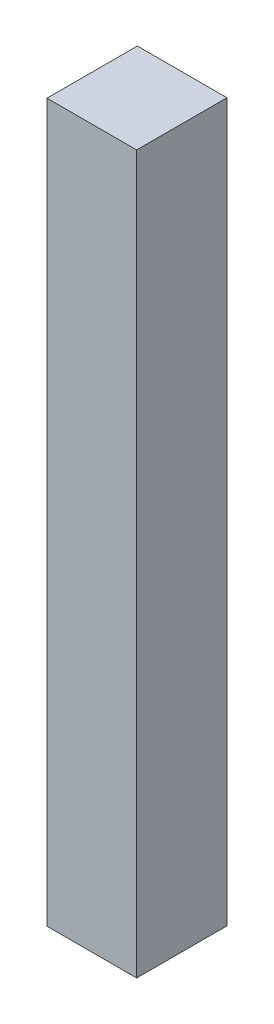
ISO-10303-21;
HEADER;
FILE_DESCRIPTION(('STEP AP214'),'2;1');
FILE_NAME('part.step','',(''),(''),'','','');
FILE_SCHEMA(('AUTOMOTIVE_DESIGN { 1 0 10303 214 1 1 1 1 }'));
ENDSEC;
DATA;
#1=APPLICATION_CONTEXT('core data for automotive mechanical design processes');
#2=APPLICATION_PROTOCOL_DEFINITION('international standard','automotive_design',2000,#1);
#3=PRODUCT_CONTEXT('',#1,'mechanical');
#4=PRODUCT('Part','Part','',(#3));
#5=PRODUCT_RELATED_PRODUCT_CATEGORY('part','',(#4));
#6=PRODUCT_DEFINITION_FORMATION('','',#4);
#7=PRODUCT_DEFINITION_CONTEXT('part definition',#1,'design');
#8=PRODUCT_DEFINITION('design','',#6,#7);
#9=PRODUCT_DEFINITION_SHAPE('','',#8);
#10=(LENGTH_UNIT() NAMED_UNIT(*) SI_UNIT(.MILLI.,.METRE.));
#11=(NAMED_UNIT(*) PLANE_ANGLE_UNIT() SI_UNIT($,.RADIAN.));
#12=(NAMED_UNIT(*) SI_UNIT($,.STERADIAN.) SOLID_ANGLE_UNIT());
#13=UNCERTAINTY_MEASURE_WITH_UNIT(LENGTH_MEASURE(1.E-05),#10,'distance_accuracy_value','');
#14=(GEOMETRIC_REPRESENTATION_CONTEXT(3) GLOBAL_UNCERTAINTY_ASSIGNED_CONTEXT((#13)) GLOBAL_UNIT_ASSIGNED_CONTEXT((#10,
#11,#12)) REPRESENTATION_CONTEXT('',''));
#15=CARTESIAN_POINT('',(0.,0.,0.));
#16=DIRECTION('',(0.,0.,1.));
#17=DIRECTION('',(1.,0.,0.));
#18=AXIS2_PLACEMENT_3D('',#15,#16,#17);
#19=CARTESIAN_POINT('',(0.,25.4,0.));
#20=DIRECTION('',(1.,0.,0.));
#21=DIRECTION('',(0.,0.,-1.));
#22=AXIS2_PLACEMENT_3D('',#19,#20,#21);
#23=PLANE('',#22);
#24=DIRECTION('',(0.,0.,1.));
#25=VECTOR('',#24,1.);
#26=CARTESIAN_POINT('',(0.,0.,0.));
#27=LINE('',#26,#25);
#28=CARTESIAN_POINT('',(0.,0.,-3.2004));
#29=VERTEX_POINT('',#28);
#30=CARTESIAN_POINT('',(0.,0.,0.));
#31=VERTEX_POINT('',#30);
#32=EDGE_CURVE('E113',#29,#31,#27,.T.);
#33=ORIENTED_EDGE('',*,*,#32,.T.);
#34=DIRECTION('',(0.,-1.,0.));
#35=VECTOR('',#34,1.);
#36=CARTESIAN_POINT('',(0.,25.4,0.));
#37=LINE('',#36,#35);
#38=CARTESIAN_POINT('',(0.,25.4,0.));
#39=VERTEX_POINT('',#38);
#40=EDGE_CURVE('E11',#39,#31,#37,.T.);
#41=ORIENTED_EDGE('',*,*,#40,.F.);
#42=DIRECTION('',(0.,0.,1.));
#43=VECTOR('',#42,1.);
#44=CARTESIAN_POINT('',(0.,25.4,0.));
#45=LINE('',#44,#43);
#46=CARTESIAN_POINT('',(0.,25.4,-3.2004));
#47=VERTEX_POINT('',#46);
#48=EDGE_CURVE('E97',#47,#39,#45,.T.);
#49=ORIENTED_EDGE('',*,*,#48,.F.);
#50=DIRECTION('',(0.,-1.,0.));
#51=VECTOR('',#50,1.);
#52=CARTESIAN_POINT('',(0.,25.4,-3.2004));
#53=LINE('',#52,#51);
#54=EDGE_CURVE('E109',#47,#29,#53,.T.);
#55=ORIENTED_EDGE('',*,*,#54,.T.);
#56=EDGE_LOOP('',(#33,#41,#49,#55));
#57=FACE_BOUND('',#56,.T.);
#58=ADVANCED_FACE('F45',(#57),#23,.F.);
#59=CARTESIAN_POINT('',(0.,25.4,0.));
#60=DIRECTION('',(0.,0.,-1.));
#61=DIRECTION('',(-1.,0.,0.));
#62=AXIS2_PLACEMENT_3D('',#59,#60,#61);
#63=PLANE('',#62);
#64=DIRECTION('',(1.,0.,0.));
#65=VECTOR('',#64,1.);
#66=CARTESIAN_POINT('',(0.,0.,0.));
#67=LINE('',#66,#65);
#68=CARTESIAN_POINT('',(3.175,0.,0.));
#69=VERTEX_POINT('',#68);
#70=EDGE_CURVE('E102',#31,#69,#67,.T.);
#71=ORIENTED_EDGE('',*,*,#70,.T.);
#72=DIRECTION('',(0.,-1.,0.));
#73=VECTOR('',#72,1.);
#74=CARTESIAN_POINT('',(3.175,25.4,0.));
#75=LINE('',#74,#73);
#76=CARTESIAN_POINT('',(3.175,25.4,0.));
#77=VERTEX_POINT('',#76);
#78=EDGE_CURVE('E54',#77,#69,#75,.T.);
#79=ORIENTED_EDGE('',*,*,#78,.F.);
#80=DIRECTION('',(1.,0.,0.));
#81=VECTOR('',#80,1.);
#82=CARTESIAN_POINT('',(0.,25.4,0.));
#83=LINE('',#82,#81);
#84=EDGE_CURVE('E92',#39,#77,#83,.T.);
#85=ORIENTED_EDGE('',*,*,#84,.F.);
#86=ORIENTED_EDGE('',*,*,#40,.T.);
#87=EDGE_LOOP('',(#71,#79,#85,#86));
#88=FACE_BOUND('',#87,.T.);
#89=ADVANCED_FACE('F101',(#88),#63,.F.);
#90=CARTESIAN_POINT('',(3.175,25.4,0.));
#91=DIRECTION('',(-1.,0.,0.));
#92=DIRECTION('',(0.,0.,1.));
#93=AXIS2_PLACEMENT_3D('',#90,#91,#92);
#94=PLANE('',#93);
#95=DIRECTION('',(0.,0.,-1.));
#96=VECTOR('',#95,1.);
#97=CARTESIAN_POINT('',(3.175,0.,0.));
#98=LINE('',#97,#96);
#99=CARTESIAN_POINT('',(3.175,0.,-3.2004));
#100=VERTEX_POINT('',#99);
#101=EDGE_CURVE('E79',#69,#100,#98,.T.);
#102=ORIENTED_EDGE('',*,*,#101,.T.);
#103=DIRECTION('',(0.,-1.,0.));
#104=VECTOR('',#103,1.);
#105=CARTESIAN_POINT('',(3.175,25.4,-3.2004));
#106=LINE('',#105,#104);
#107=CARTESIAN_POINT('',(3.175,25.4,-3.2004));
#108=VERTEX_POINT('',#107);
#109=EDGE_CURVE('E104',#108,#100,#106,.T.);
#110=ORIENTED_EDGE('',*,*,#109,.F.);
#111=DIRECTION('',(0.,0.,-1.));
#112=VECTOR('',#111,1.);
#113=CARTESIAN_POINT('',(3.175,25.4,0.));
#114=LINE('',#113,#112);
#115=EDGE_CURVE('E95',#77,#108,#114,.T.);
#116=ORIENTED_EDGE('',*,*,#115,.F.);
#117=ORIENTED_EDGE('',*,*,#78,.T.);
#118=EDGE_LOOP('',(#102,#110,#116,#117));
#119=FACE_BOUND('',#118,.T.);
#120=ADVANCED_FACE('F105',(#119),#94,.F.);
#121=CARTESIAN_POINT('',(0.,25.4,-3.2004));
#122=DIRECTION('',(0.,0.,1.));
#123=DIRECTION('',(1.,0.,0.));
#124=AXIS2_PLACEMENT_3D('',#121,#122,#123);
#125=PLANE('',#124);
#126=DIRECTION('',(-1.,0.,0.));
#127=VECTOR('',#126,1.);
#128=CARTESIAN_POINT('',(0.,0.,-3.2004));
#129=LINE('',#128,#127);
#130=EDGE_CURVE('E85',#100,#29,#129,.T.);
#131=ORIENTED_EDGE('',*,*,#130,.T.);
#132=ORIENTED_EDGE('',*,*,#54,.F.);
#133=DIRECTION('',(-1.,0.,0.));
#134=VECTOR('',#133,1.);
#135=CARTESIAN_POINT('',(0.,25.4,-3.2004));
#136=LINE('',#135,#134);
#137=EDGE_CURVE('E62',#108,#47,#136,.T.);
#138=ORIENTED_EDGE('',*,*,#137,.F.);
#139=ORIENTED_EDGE('',*,*,#109,.T.);
#140=EDGE_LOOP('',(#131,#132,#138,#139));
#141=FACE_BOUND('',#140,.T.);
#142=ADVANCED_FACE('F126',(#141),#125,.F.);
#143=CARTESIAN_POINT('',(0.,25.4,0.));
#144=DIRECTION('',(0.,-1.,0.));
#145=DIRECTION('',(0.,0.,-1.));
#146=AXIS2_PLACEMENT_3D('',#143,#144,#145);
#147=PLANE('',#146);
#148=ORIENTED_EDGE('',*,*,#48,.T.);
#149=ORIENTED_EDGE('',*,*,#84,.T.);
#150=ORIENTED_EDGE('',*,*,#115,.T.);
#151=ORIENTED_EDGE('',*,*,#137,.T.);
#152=EDGE_LOOP('',(#148,#149,#150,#151));
#153=FACE_BOUND('',#152,.T.);
#154=ADVANCED_FACE('F93',(#153),#147,.F.);
#155=CARTESIAN_POINT('',(0.,0.,0.));
#156=DIRECTION('',(0.,-1.,0.));
#157=DIRECTION('',(0.,0.,-1.));
#158=AXIS2_PLACEMENT_3D('',#155,#156,#157);
#159=PLANE('',#158);
#160=ORIENTED_EDGE('',*,*,#32,.F.);
#161=ORIENTED_EDGE('',*,*,#130,.F.);
#162=ORIENTED_EDGE('',*,*,#101,.F.);
#163=ORIENTED_EDGE('',*,*,#70,.F.);
#164=EDGE_LOOP('',(#160,#161,#162,#163));
#165=FACE_BOUND('',#164,.T.);
#166=ADVANCED_FACE('F129',(#165),#159,.T.);
#167=CLOSED_SHELL('',(#58,#89,#120,#142,#154,#166));
#168=MANIFOLD_SOLID_BREP('B2',#167);
#169=ADVANCED_BREP_SHAPE_REPRESENTATION('',(#18,#168),#14);
#170=SHAPE_DEFINITION_REPRESENTATION(#9,#169);
ENDSEC;
END-ISO-10303-21;
